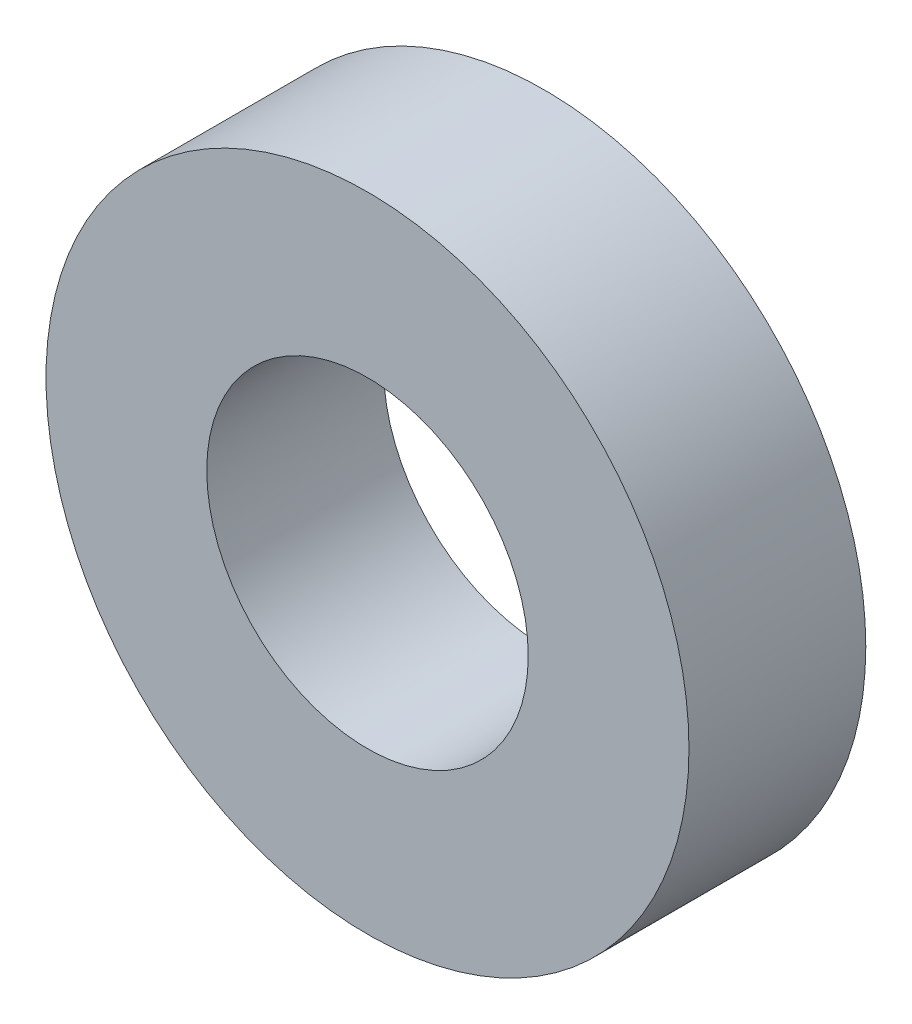
ISO-10303-21;
HEADER;
FILE_DESCRIPTION(('STEP AP214'),'2;1');
FILE_NAME('part.step','',(''),(''),'','','');
FILE_SCHEMA(('AUTOMOTIVE_DESIGN { 1 0 10303 214 1 1 1 1 }'));
ENDSEC;
DATA;
#1=APPLICATION_CONTEXT('core data for automotive mechanical design processes');
#2=APPLICATION_PROTOCOL_DEFINITION('international standard','automotive_design',2000,#1);
#3=PRODUCT_CONTEXT('',#1,'mechanical');
#4=PRODUCT('Part','Part','',(#3));
#5=PRODUCT_RELATED_PRODUCT_CATEGORY('part','',(#4));
#6=PRODUCT_DEFINITION_FORMATION('','',#4);
#7=PRODUCT_DEFINITION_CONTEXT('part definition',#1,'design');
#8=PRODUCT_DEFINITION('design','',#6,#7);
#9=PRODUCT_DEFINITION_SHAPE('','',#8);
#10=(LENGTH_UNIT() NAMED_UNIT(*) SI_UNIT(.MILLI.,.METRE.));
#11=(NAMED_UNIT(*) PLANE_ANGLE_UNIT() SI_UNIT($,.RADIAN.));
#12=(NAMED_UNIT(*) SI_UNIT($,.STERADIAN.) SOLID_ANGLE_UNIT());
#13=UNCERTAINTY_MEASURE_WITH_UNIT(LENGTH_MEASURE(1.E-05),#10,'distance_accuracy_value','');
#14=(GEOMETRIC_REPRESENTATION_CONTEXT(3) GLOBAL_UNCERTAINTY_ASSIGNED_CONTEXT((#13)) GLOBAL_UNIT_ASSIGNED_CONTEXT((#10,
#11,#12)) REPRESENTATION_CONTEXT('',''));
#15=CARTESIAN_POINT('',(0.,0.,0.));
#16=DIRECTION('',(0.,0.,1.));
#17=DIRECTION('',(1.,0.,0.));
#18=AXIS2_PLACEMENT_3D('',#15,#16,#17);
#19=CARTESIAN_POINT('',(0.,0.,11.));
#20=DIRECTION('',(0.,0.,1.));
#21=DIRECTION('',(1.,0.,0.));
#22=AXIS2_PLACEMENT_3D('',#19,#20,#21);
#23=PLANE('',#22);
#24=CARTESIAN_POINT('',(0.,0.,11.));
#25=DIRECTION('',(0.,0.,1.));
#26=DIRECTION('',(1.,0.,0.));
#27=AXIS2_PLACEMENT_3D('',#24,#25,#26);
#28=CIRCLE('',#27,20.);
#29=CARTESIAN_POINT('',(20.,0.,11.));
#30=VERTEX_POINT('',#29);
#31=EDGE_CURVE('E10',#30,#30,#28,.T.);
#32=ORIENTED_EDGE('',*,*,#31,.T.);
#33=EDGE_LOOP('',(#32));
#34=FACE_BOUND('',#33,.T.);
#35=CARTESIAN_POINT('',(0.,0.,11.));
#36=DIRECTION('',(0.,0.,1.));
#37=DIRECTION('',(1.,0.,0.));
#38=AXIS2_PLACEMENT_3D('',#35,#36,#37);
#39=CIRCLE('',#38,10.);
#40=CARTESIAN_POINT('',(10.,0.,11.));
#41=VERTEX_POINT('',#40);
#42=EDGE_CURVE('E54',#41,#41,#39,.T.);
#43=ORIENTED_EDGE('',*,*,#42,.F.);
#44=EDGE_LOOP('',(#43));
#45=FACE_BOUND('',#44,.T.);
#46=ADVANCED_FACE('F41',(#34,#45),#23,.T.);
#47=CARTESIAN_POINT('',(0.,0.,0.));
#48=DIRECTION('',(0.,0.,1.));
#49=DIRECTION('',(1.,0.,0.));
#50=AXIS2_PLACEMENT_3D('',#47,#48,#49);
#51=PLANE('',#50);
#52=CARTESIAN_POINT('',(0.,0.,0.));
#53=DIRECTION('',(0.,0.,1.));
#54=DIRECTION('',(1.,0.,0.));
#55=AXIS2_PLACEMENT_3D('',#52,#53,#54);
#56=CIRCLE('',#55,20.);
#57=CARTESIAN_POINT('',(20.,0.,0.));
#58=VERTEX_POINT('',#57);
#59=EDGE_CURVE('E45',#58,#58,#56,.T.);
#60=ORIENTED_EDGE('',*,*,#59,.F.);
#61=EDGE_LOOP('',(#60));
#62=FACE_BOUND('',#61,.T.);
#63=CARTESIAN_POINT('',(0.,0.,0.));
#64=DIRECTION('',(0.,0.,1.));
#65=DIRECTION('',(1.,0.,0.));
#66=AXIS2_PLACEMENT_3D('',#63,#64,#65);
#67=CIRCLE('',#66,10.);
#68=CARTESIAN_POINT('',(10.,0.,0.));
#69=VERTEX_POINT('',#68);
#70=EDGE_CURVE('E56',#69,#69,#67,.T.);
#71=ORIENTED_EDGE('',*,*,#70,.T.);
#72=EDGE_LOOP('',(#71));
#73=FACE_BOUND('',#72,.T.);
#74=ADVANCED_FACE('F68',(#62,#73),#51,.F.);
#75=CARTESIAN_POINT('',(0.,0.,11.));
#76=DIRECTION('',(0.,0.,-1.));
#77=DIRECTION('',(-1.,0.,0.));
#78=AXIS2_PLACEMENT_3D('',#75,#76,#77);
#79=CYLINDRICAL_SURFACE('',#78,20.);
#80=ORIENTED_EDGE('',*,*,#31,.F.);
#81=EDGE_LOOP('',(#80));
#82=FACE_BOUND('',#81,.T.);
#83=ORIENTED_EDGE('',*,*,#59,.T.);
#84=EDGE_LOOP('',(#83));
#85=FACE_BOUND('',#84,.T.);
#86=ADVANCED_FACE('F43',(#82,#85),#79,.T.);
#87=CARTESIAN_POINT('',(0.,0.,11.));
#88=DIRECTION('',(0.,0.,-1.));
#89=DIRECTION('',(-1.,0.,0.));
#90=AXIS2_PLACEMENT_3D('',#87,#88,#89);
#91=CYLINDRICAL_SURFACE('',#90,10.);
#92=ORIENTED_EDGE('',*,*,#42,.T.);
#93=EDGE_LOOP('',(#92));
#94=FACE_BOUND('',#93,.T.);
#95=ORIENTED_EDGE('',*,*,#70,.F.);
#96=EDGE_LOOP('',(#95));
#97=FACE_BOUND('',#96,.T.);
#98=ADVANCED_FACE('F64',(#94,#97),#91,.F.);
#99=CLOSED_SHELL('',(#46,#74,#86,#98));
#100=MANIFOLD_SOLID_BREP('B2',#99);
#101=ADVANCED_BREP_SHAPE_REPRESENTATION('',(#18,#100),#14);
#102=SHAPE_DEFINITION_REPRESENTATION(#9,#101);
ENDSEC;
END-ISO-10303-21;
